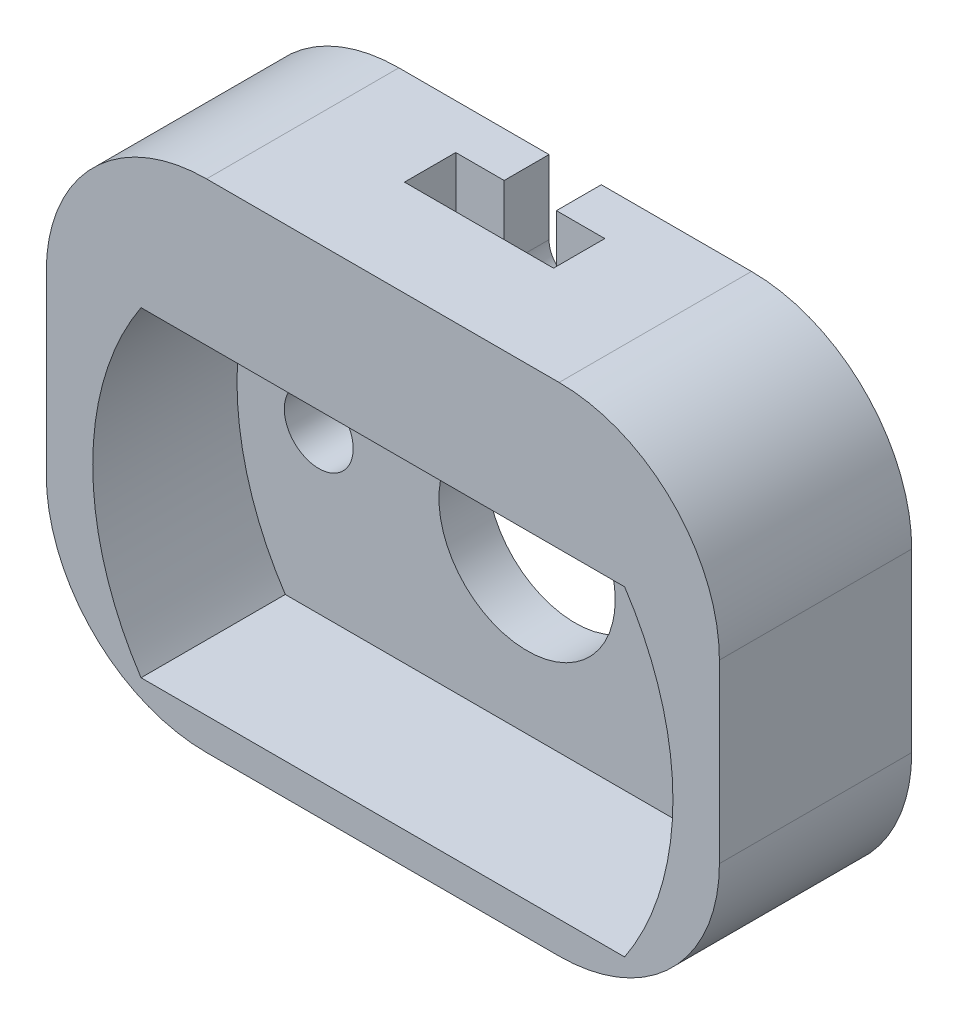
ISO-10303-21;
HEADER;
FILE_DESCRIPTION(('STEP AP214'),'2;1');
FILE_NAME('part.step','',(''),(''),'','','');
FILE_SCHEMA(('AUTOMOTIVE_DESIGN { 1 0 10303 214 1 1 1 1 }'));
ENDSEC;
DATA;
#1=APPLICATION_CONTEXT('core data for automotive mechanical design processes');
#2=APPLICATION_PROTOCOL_DEFINITION('international standard','automotive_design',2000,#1);
#3=PRODUCT_CONTEXT('',#1,'mechanical');
#4=PRODUCT('Part','Part','',(#3));
#5=PRODUCT_RELATED_PRODUCT_CATEGORY('part','',(#4));
#6=PRODUCT_DEFINITION_FORMATION('','',#4);
#7=PRODUCT_DEFINITION_CONTEXT('part definition',#1,'design');
#8=PRODUCT_DEFINITION('design','',#6,#7);
#9=PRODUCT_DEFINITION_SHAPE('','',#8);
#10=(LENGTH_UNIT() NAMED_UNIT(*) SI_UNIT(.MILLI.,.METRE.));
#11=(NAMED_UNIT(*) PLANE_ANGLE_UNIT() SI_UNIT($,.RADIAN.));
#12=(NAMED_UNIT(*) SI_UNIT($,.STERADIAN.) SOLID_ANGLE_UNIT());
#13=UNCERTAINTY_MEASURE_WITH_UNIT(LENGTH_MEASURE(1.E-05),#10,'distance_accuracy_value','');
#14=(GEOMETRIC_REPRESENTATION_CONTEXT(3) GLOBAL_UNCERTAINTY_ASSIGNED_CONTEXT((#13)) GLOBAL_UNIT_ASSIGNED_CONTEXT((#10,
#11,#12)) REPRESENTATION_CONTEXT('',''));
#15=CARTESIAN_POINT('',(0.,0.,0.));
#16=DIRECTION('',(0.,0.,1.));
#17=DIRECTION('',(1.,0.,0.));
#18=AXIS2_PLACEMENT_3D('',#15,#16,#17);
#19=CARTESIAN_POINT('',(0.,0.,12.));
#20=DIRECTION('',(0.,1.,0.));
#21=DIRECTION('',(0.,0.,1.));
#22=AXIS2_PLACEMENT_3D('',#19,#20,#21);
#23=PLANE('',#22);
#24=DIRECTION('',(1.,0.,0.));
#25=VECTOR('',#24,1.);
#26=CARTESIAN_POINT('',(0.,0.,12.));
#27=LINE('',#26,#25);
#28=CARTESIAN_POINT('',(10.,0.,12.));
#29=VERTEX_POINT('',#28);
#30=CARTESIAN_POINT('',(32.,0.,12.));
#31=VERTEX_POINT('',#30);
#32=EDGE_CURVE('E284',#29,#31,#27,.T.);
#33=ORIENTED_EDGE('',*,*,#32,.F.);
#34=DIRECTION('',(0.,0.,-1.));
#35=VECTOR('',#34,1.);
#36=CARTESIAN_POINT('',(10.,0.,0.));
#37=LINE('',#36,#35);
#38=CARTESIAN_POINT('',(10.,0.,0.));
#39=VERTEX_POINT('',#38);
#40=EDGE_CURVE('E329',#29,#39,#37,.T.);
#41=ORIENTED_EDGE('',*,*,#40,.T.);
#42=DIRECTION('',(1.,0.,0.));
#43=VECTOR('',#42,1.);
#44=CARTESIAN_POINT('',(0.,0.,0.));
#45=LINE('',#44,#43);
#46=CARTESIAN_POINT('',(32.,0.,0.));
#47=VERTEX_POINT('',#46);
#48=EDGE_CURVE('E277',#39,#47,#45,.T.);
#49=ORIENTED_EDGE('',*,*,#48,.T.);
#50=DIRECTION('',(0.,0.,-1.));
#51=VECTOR('',#50,1.);
#52=CARTESIAN_POINT('',(32.,0.,12.));
#53=LINE('',#52,#51);
#54=EDGE_CURVE('E327',#47,#31,#53,.F.);
#55=ORIENTED_EDGE('',*,*,#54,.T.);
#56=EDGE_LOOP('',(#33,#41,#49,#55));
#57=FACE_BOUND('',#56,.T.);
#58=ADVANCED_FACE('F34',(#57),#23,.F.);
#59=CARTESIAN_POINT('',(42.,0.,12.));
#60=DIRECTION('',(-1.,0.,0.));
#61=DIRECTION('',(0.,0.,1.));
#62=AXIS2_PLACEMENT_3D('',#59,#60,#61);
#63=PLANE('',#62);
#64=DIRECTION('',(0.,1.,0.));
#65=VECTOR('',#64,1.);
#66=CARTESIAN_POINT('',(42.,0.,12.));
#67=LINE('',#66,#65);
#68=CARTESIAN_POINT('',(42.,10.,12.));
#69=VERTEX_POINT('',#68);
#70=CARTESIAN_POINT('',(42.,21.,12.));
#71=VERTEX_POINT('',#70);
#72=EDGE_CURVE('E286',#69,#71,#67,.T.);
#73=ORIENTED_EDGE('',*,*,#72,.F.);
#74=DIRECTION('',(0.,0.,-1.));
#75=VECTOR('',#74,1.);
#76=CARTESIAN_POINT('',(42.,10.,12.));
#77=LINE('',#76,#75);
#78=CARTESIAN_POINT('',(42.,10.,0.));
#79=VERTEX_POINT('',#78);
#80=EDGE_CURVE('E11',#69,#79,#77,.T.);
#81=ORIENTED_EDGE('',*,*,#80,.T.);
#82=DIRECTION('',(0.,1.,0.));
#83=VECTOR('',#82,1.);
#84=CARTESIAN_POINT('',(42.,0.,0.));
#85=LINE('',#84,#83);
#86=CARTESIAN_POINT('',(42.,21.,0.));
#87=VERTEX_POINT('',#86);
#88=EDGE_CURVE('E298',#79,#87,#85,.T.);
#89=ORIENTED_EDGE('',*,*,#88,.T.);
#90=DIRECTION('',(0.,0.,-1.));
#91=VECTOR('',#90,1.);
#92=CARTESIAN_POINT('',(42.,21.,12.));
#93=LINE('',#92,#91);
#94=EDGE_CURVE('E42',#87,#71,#93,.F.);
#95=ORIENTED_EDGE('',*,*,#94,.T.);
#96=EDGE_LOOP('',(#73,#81,#89,#95));
#97=FACE_BOUND('',#96,.T.);
#98=ADVANCED_FACE('F343',(#97),#63,.F.);
#99=CARTESIAN_POINT('',(0.,31.,12.));
#100=DIRECTION('',(0.,1.,0.));
#101=DIRECTION('',(0.,0.,1.));
#102=AXIS2_PLACEMENT_3D('',#99,#100,#101);
#103=PLANE('',#102);
#104=DIRECTION('',(1.,0.,0.));
#105=VECTOR('',#104,1.);
#106=CARTESIAN_POINT('',(0.,31.,0.));
#107=LINE('',#106,#105);
#108=CARTESIAN_POINT('',(10.,31.,0.));
#109=VERTEX_POINT('',#108);
#110=CARTESIAN_POINT('',(19.37,31.,0.));
#111=VERTEX_POINT('',#110);
#112=EDGE_CURVE('E193',#109,#111,#107,.T.);
#113=ORIENTED_EDGE('',*,*,#112,.F.);
#114=DIRECTION('',(0.,0.,-1.));
#115=VECTOR('',#114,1.);
#116=CARTESIAN_POINT('',(10.,31.,12.));
#117=LINE('',#116,#115);
#118=CARTESIAN_POINT('',(10.,31.,12.));
#119=VERTEX_POINT('',#118);
#120=EDGE_CURVE('E318',#109,#119,#117,.F.);
#121=ORIENTED_EDGE('',*,*,#120,.T.);
#122=DIRECTION('',(1.,0.,0.));
#123=VECTOR('',#122,1.);
#124=CARTESIAN_POINT('',(0.,31.,12.));
#125=LINE('',#124,#123);
#126=CARTESIAN_POINT('',(32.,31.,12.));
#127=VERTEX_POINT('',#126);
#128=EDGE_CURVE('E289',#119,#127,#125,.T.);
#129=ORIENTED_EDGE('',*,*,#128,.T.);
#130=DIRECTION('',(0.,0.,-1.));
#131=VECTOR('',#130,1.);
#132=CARTESIAN_POINT('',(32.,31.,0.));
#133=LINE('',#132,#131);
#134=CARTESIAN_POINT('',(32.,31.,0.));
#135=VERTEX_POINT('',#134);
#136=EDGE_CURVE('E315',#127,#135,#133,.T.);
#137=ORIENTED_EDGE('',*,*,#136,.T.);
#138=CARTESIAN_POINT('',(22.63,31.,0.));
#139=VERTEX_POINT('',#138);
#140=EDGE_CURVE('E300',#139,#135,#107,.T.);
#141=ORIENTED_EDGE('',*,*,#140,.F.);
#142=DIRECTION('',(0.,0.,-1.));
#143=VECTOR('',#142,1.);
#144=CARTESIAN_POINT('',(22.63,31.,8.43804930804973));
#145=LINE('',#144,#143);
#146=CARTESIAN_POINT('',(22.63,31.,2.8));
#147=VERTEX_POINT('',#146);
#148=EDGE_CURVE('E362',#147,#139,#145,.T.);
#149=ORIENTED_EDGE('',*,*,#148,.F.);
#150=DIRECTION('',(-1.,0.,0.));
#151=VECTOR('',#150,1.);
#152=CARTESIAN_POINT('',(25.65,31.,2.8));
#153=LINE('',#152,#151);
#154=CARTESIAN_POINT('',(25.65,31.,2.8));
#155=VERTEX_POINT('',#154);
#156=EDGE_CURVE('E222',#155,#147,#153,.T.);
#157=ORIENTED_EDGE('',*,*,#156,.F.);
#158=DIRECTION('',(0.,0.,-1.));
#159=VECTOR('',#158,1.);
#160=CARTESIAN_POINT('',(25.65,31.,6.));
#161=LINE('',#160,#159);
#162=CARTESIAN_POINT('',(25.65,31.,6.));
#163=VERTEX_POINT('',#162);
#164=EDGE_CURVE('E201',#163,#155,#161,.T.);
#165=ORIENTED_EDGE('',*,*,#164,.F.);
#166=DIRECTION('',(1.,0.,0.));
#167=VECTOR('',#166,1.);
#168=CARTESIAN_POINT('',(25.65,31.,6.));
#169=LINE('',#168,#167);
#170=CARTESIAN_POINT('',(16.35,31.,6.));
#171=VERTEX_POINT('',#170);
#172=EDGE_CURVE('E210',#171,#163,#169,.T.);
#173=ORIENTED_EDGE('',*,*,#172,.F.);
#174=DIRECTION('',(0.,0.,1.));
#175=VECTOR('',#174,1.);
#176=CARTESIAN_POINT('',(16.35,31.,6.));
#177=LINE('',#176,#175);
#178=CARTESIAN_POINT('',(16.35,31.,2.8));
#179=VERTEX_POINT('',#178);
#180=EDGE_CURVE('E225',#179,#171,#177,.T.);
#181=ORIENTED_EDGE('',*,*,#180,.F.);
#182=CARTESIAN_POINT('',(19.37,31.,2.8));
#183=VERTEX_POINT('',#182);
#184=EDGE_CURVE('E221',#183,#179,#153,.T.);
#185=ORIENTED_EDGE('',*,*,#184,.F.);
#186=DIRECTION('',(0.,0.,-1.));
#187=VECTOR('',#186,1.);
#188=CARTESIAN_POINT('',(19.37,31.,8.43804930804973));
#189=LINE('',#188,#187);
#190=EDGE_CURVE('E183',#183,#111,#189,.T.);
#191=ORIENTED_EDGE('',*,*,#190,.T.);
#192=EDGE_LOOP('',(#113,#121,#129,#137,#141,#149,#157,#165,#173,#181,#185,#191));
#193=FACE_BOUND('',#192,.T.);
#194=ADVANCED_FACE('F352',(#193),#103,.T.);
#195=CARTESIAN_POINT('',(0.,0.,12.));
#196=DIRECTION('',(-1.,0.,0.));
#197=DIRECTION('',(0.,0.,1.));
#198=AXIS2_PLACEMENT_3D('',#195,#196,#197);
#199=PLANE('',#198);
#200=DIRECTION('',(0.,1.,0.));
#201=VECTOR('',#200,1.);
#202=CARTESIAN_POINT('',(0.,0.,12.));
#203=LINE('',#202,#201);
#204=CARTESIAN_POINT('',(0.,10.,12.));
#205=VERTEX_POINT('',#204);
#206=CARTESIAN_POINT('',(0.,21.,12.));
#207=VERTEX_POINT('',#206);
#208=EDGE_CURVE('E292',#205,#207,#203,.T.);
#209=ORIENTED_EDGE('',*,*,#208,.T.);
#210=DIRECTION('',(0.,0.,-1.));
#211=VECTOR('',#210,1.);
#212=CARTESIAN_POINT('',(0.,21.,12.));
#213=LINE('',#212,#211);
#214=CARTESIAN_POINT('',(0.,21.,0.));
#215=VERTEX_POINT('',#214);
#216=EDGE_CURVE('E304',#207,#215,#213,.T.);
#217=ORIENTED_EDGE('',*,*,#216,.T.);
#218=DIRECTION('',(0.,1.,0.));
#219=VECTOR('',#218,1.);
#220=CARTESIAN_POINT('',(0.,0.,0.));
#221=LINE('',#220,#219);
#222=CARTESIAN_POINT('',(0.,10.,0.));
#223=VERTEX_POINT('',#222);
#224=EDGE_CURVE('E287',#223,#215,#221,.T.);
#225=ORIENTED_EDGE('',*,*,#224,.F.);
#226=DIRECTION('',(0.,0.,-1.));
#227=VECTOR('',#226,1.);
#228=CARTESIAN_POINT('',(0.,10.,12.));
#229=LINE('',#228,#227);
#230=EDGE_CURVE('E295',#223,#205,#229,.F.);
#231=ORIENTED_EDGE('',*,*,#230,.T.);
#232=EDGE_LOOP('',(#209,#217,#225,#231));
#233=FACE_BOUND('',#232,.T.);
#234=ADVANCED_FACE('F403',(#233),#199,.T.);
#235=CARTESIAN_POINT('',(0.,0.,12.));
#236=DIRECTION('',(0.,0.,1.));
#237=DIRECTION('',(1.,0.,0.));
#238=AXIS2_PLACEMENT_3D('',#235,#236,#237);
#239=PLANE('',#238);
#240=CARTESIAN_POINT('',(21.,12.,12.));
#241=DIRECTION('',(0.,0.,1.));
#242=DIRECTION('',(1.,0.,0.));
#243=AXIS2_PLACEMENT_3D('',#240,#241,#242);
#244=CIRCLE('',#243,18.1);
#245=CARTESIAN_POINT('',(36.0867491528162,2.,12.));
#246=VERTEX_POINT('',#245);
#247=CARTESIAN_POINT('',(36.0867491528162,22.,12.));
#248=VERTEX_POINT('',#247);
#249=EDGE_CURVE('E251',#246,#248,#244,.T.);
#250=ORIENTED_EDGE('',*,*,#249,.F.);
#251=DIRECTION('',(1.,0.,0.));
#252=VECTOR('',#251,1.);
#253=CARTESIAN_POINT('',(5.91325084718381,2.,12.));
#254=LINE('',#253,#252);
#255=CARTESIAN_POINT('',(5.91325084718381,2.00000000000001,12.));
#256=VERTEX_POINT('',#255);
#257=EDGE_CURVE('E256',#256,#246,#254,.T.);
#258=ORIENTED_EDGE('',*,*,#257,.F.);
#259=CARTESIAN_POINT('',(21.,12.,12.));
#260=DIRECTION('',(0.,0.,1.));
#261=DIRECTION('',(1.,0.,0.));
#262=AXIS2_PLACEMENT_3D('',#259,#260,#261);
#263=CIRCLE('',#262,18.1);
#264=CARTESIAN_POINT('',(5.91325084718381,22.,12.));
#265=VERTEX_POINT('',#264);
#266=EDGE_CURVE('E270',#265,#256,#263,.T.);
#267=ORIENTED_EDGE('',*,*,#266,.F.);
#268=DIRECTION('',(-1.,0.,0.));
#269=VECTOR('',#268,1.);
#270=CARTESIAN_POINT('',(36.0867491528162,22.,12.));
#271=LINE('',#270,#269);
#272=EDGE_CURVE('E267',#248,#265,#271,.T.);
#273=ORIENTED_EDGE('',*,*,#272,.F.);
#274=EDGE_LOOP('',(#250,#258,#267,#273));
#275=FACE_BOUND('',#274,.T.);
#276=ORIENTED_EDGE('',*,*,#128,.F.);
#277=CARTESIAN_POINT('',(10.,21.,12.));
#278=DIRECTION('',(0.,0.,1.));
#279=DIRECTION('',(1.,0.,0.));
#280=AXIS2_PLACEMENT_3D('',#277,#278,#279);
#281=CIRCLE('',#280,10.);
#282=EDGE_CURVE('E325',#119,#207,#281,.T.);
#283=ORIENTED_EDGE('',*,*,#282,.T.);
#284=ORIENTED_EDGE('',*,*,#208,.F.);
#285=CARTESIAN_POINT('',(10.,10.,12.));
#286=DIRECTION('',(0.,0.,1.));
#287=DIRECTION('',(1.,0.,0.));
#288=AXIS2_PLACEMENT_3D('',#285,#286,#287);
#289=CIRCLE('',#288,10.);
#290=EDGE_CURVE('E323',#205,#29,#289,.T.);
#291=ORIENTED_EDGE('',*,*,#290,.T.);
#292=ORIENTED_EDGE('',*,*,#32,.T.);
#293=CARTESIAN_POINT('',(32.,10.,12.));
#294=DIRECTION('',(0.,0.,1.));
#295=DIRECTION('',(1.,0.,0.));
#296=AXIS2_PLACEMENT_3D('',#293,#294,#295);
#297=CIRCLE('',#296,10.);
#298=EDGE_CURVE('E55',#31,#69,#297,.T.);
#299=ORIENTED_EDGE('',*,*,#298,.T.);
#300=ORIENTED_EDGE('',*,*,#72,.T.);
#301=CARTESIAN_POINT('',(32.,21.,12.));
#302=DIRECTION('',(0.,0.,1.));
#303=DIRECTION('',(1.,0.,0.));
#304=AXIS2_PLACEMENT_3D('',#301,#302,#303);
#305=CIRCLE('',#304,10.);
#306=EDGE_CURVE('E320',#71,#127,#305,.T.);
#307=ORIENTED_EDGE('',*,*,#306,.T.);
#308=EDGE_LOOP('',(#276,#283,#284,#291,#292,#299,#300,#307));
#309=FACE_BOUND('',#308,.T.);
#310=ADVANCED_FACE('F346',(#275,#309),#239,.T.);
#311=CARTESIAN_POINT('',(0.,0.,0.));
#312=DIRECTION('',(0.,0.,1.));
#313=DIRECTION('',(1.,0.,0.));
#314=AXIS2_PLACEMENT_3D('',#311,#312,#313);
#315=PLANE('',#314);
#316=CARTESIAN_POINT('',(21.,12.,0.));
#317=DIRECTION('',(0.,0.,1.));
#318=DIRECTION('',(1.,0.,0.));
#319=AXIS2_PLACEMENT_3D('',#316,#317,#318);
#320=CIRCLE('',#319,5.5);
#321=CARTESIAN_POINT('',(26.5,12.,0.));
#322=VERTEX_POINT('',#321);
#323=EDGE_CURVE('E355',#322,#322,#320,.T.);
#324=ORIENTED_EDGE('',*,*,#323,.T.);
#325=EDGE_LOOP('',(#324));
#326=FACE_BOUND('',#325,.T.);
#327=CARTESIAN_POINT('',(8.,12.,0.));
#328=DIRECTION('',(0.,0.,1.));
#329=DIRECTION('',(1.,0.,0.));
#330=AXIS2_PLACEMENT_3D('',#327,#328,#329);
#331=CIRCLE('',#330,2.15);
#332=CARTESIAN_POINT('',(10.15,12.,0.));
#333=VERTEX_POINT('',#332);
#334=EDGE_CURVE('E248',#333,#333,#331,.T.);
#335=ORIENTED_EDGE('',*,*,#334,.T.);
#336=EDGE_LOOP('',(#335));
#337=FACE_BOUND('',#336,.T.);
#338=CARTESIAN_POINT('',(34.,12.,0.));
#339=DIRECTION('',(0.,0.,1.));
#340=DIRECTION('',(1.,0.,0.));
#341=AXIS2_PLACEMENT_3D('',#338,#339,#340);
#342=CIRCLE('',#341,2.15);
#343=CARTESIAN_POINT('',(36.15,12.,0.));
#344=VERTEX_POINT('',#343);
#345=EDGE_CURVE('E243',#344,#344,#342,.T.);
#346=ORIENTED_EDGE('',*,*,#345,.T.);
#347=EDGE_LOOP('',(#346));
#348=FACE_BOUND('',#347,.T.);
#349=ORIENTED_EDGE('',*,*,#224,.T.);
#350=CARTESIAN_POINT('',(10.,21.,0.));
#351=DIRECTION('',(0.,0.,1.));
#352=DIRECTION('',(1.,0.,0.));
#353=AXIS2_PLACEMENT_3D('',#350,#351,#352);
#354=CIRCLE('',#353,10.);
#355=EDGE_CURVE('E313',#215,#109,#354,.F.);
#356=ORIENTED_EDGE('',*,*,#355,.T.);
#357=ORIENTED_EDGE('',*,*,#112,.T.);
#358=DIRECTION('',(0.,1.,0.));
#359=VECTOR('',#358,1.);
#360=CARTESIAN_POINT('',(19.37,31.,0.));
#361=LINE('',#360,#359);
#362=CARTESIAN_POINT('',(19.37,26.4,0.));
#363=VERTEX_POINT('',#362);
#364=EDGE_CURVE('E175',#363,#111,#361,.T.);
#365=ORIENTED_EDGE('',*,*,#364,.F.);
#366=CARTESIAN_POINT('',(21.,26.4,0.));
#367=DIRECTION('',(0.,0.,-1.));
#368=DIRECTION('',(-1.,0.,0.));
#369=AXIS2_PLACEMENT_3D('',#366,#367,#368);
#370=CIRCLE('',#369,1.63);
#371=CARTESIAN_POINT('',(22.63,26.4,0.));
#372=VERTEX_POINT('',#371);
#373=EDGE_CURVE('E191',#372,#363,#370,.T.);
#374=ORIENTED_EDGE('',*,*,#373,.F.);
#375=DIRECTION('',(0.,-1.,0.));
#376=VECTOR('',#375,1.);
#377=CARTESIAN_POINT('',(22.63,31.,0.));
#378=LINE('',#377,#376);
#379=EDGE_CURVE('E194',#139,#372,#378,.T.);
#380=ORIENTED_EDGE('',*,*,#379,.F.);
#381=ORIENTED_EDGE('',*,*,#140,.T.);
#382=CARTESIAN_POINT('',(32.,21.,0.));
#383=DIRECTION('',(0.,0.,1.));
#384=DIRECTION('',(1.,0.,0.));
#385=AXIS2_PLACEMENT_3D('',#382,#383,#384);
#386=CIRCLE('',#385,10.);
#387=EDGE_CURVE('E307',#135,#87,#386,.F.);
#388=ORIENTED_EDGE('',*,*,#387,.T.);
#389=ORIENTED_EDGE('',*,*,#88,.F.);
#390=CARTESIAN_POINT('',(32.,10.,0.));
#391=DIRECTION('',(0.,0.,1.));
#392=DIRECTION('',(1.,0.,0.));
#393=AXIS2_PLACEMENT_3D('',#390,#391,#392);
#394=CIRCLE('',#393,10.);
#395=EDGE_CURVE('E309',#79,#47,#394,.F.);
#396=ORIENTED_EDGE('',*,*,#395,.T.);
#397=ORIENTED_EDGE('',*,*,#48,.F.);
#398=CARTESIAN_POINT('',(10.,10.,0.));
#399=DIRECTION('',(0.,0.,1.));
#400=DIRECTION('',(1.,0.,0.));
#401=AXIS2_PLACEMENT_3D('',#398,#399,#400);
#402=CIRCLE('',#401,10.);
#403=EDGE_CURVE('E311',#39,#223,#402,.F.);
#404=ORIENTED_EDGE('',*,*,#403,.T.);
#405=EDGE_LOOP('',(#349,#356,#357,#365,#374,#380,#381,#388,#389,#396,#397,#404));
#406=FACE_BOUND('',#405,.T.);
#407=ADVANCED_FACE('F189',(#326,#337,#348,#406),#315,.F.);
#408=CARTESIAN_POINT('',(21.,12.,3.));
#409=DIRECTION('',(0.,0.,1.));
#410=DIRECTION('',(1.,0.,0.));
#411=AXIS2_PLACEMENT_3D('',#408,#409,#410);
#412=CYLINDRICAL_SURFACE('',#411,18.1);
#413=ORIENTED_EDGE('',*,*,#249,.T.);
#414=DIRECTION('',(0.,0.,1.));
#415=VECTOR('',#414,1.);
#416=CARTESIAN_POINT('',(36.0867491528162,22.,3.));
#417=LINE('',#416,#415);
#418=CARTESIAN_POINT('',(36.0867491528162,22.,3.));
#419=VERTEX_POINT('',#418);
#420=EDGE_CURVE('E265',#419,#248,#417,.T.);
#421=ORIENTED_EDGE('',*,*,#420,.F.);
#422=CARTESIAN_POINT('',(21.,12.,3.));
#423=DIRECTION('',(0.,0.,1.));
#424=DIRECTION('',(1.,0.,0.));
#425=AXIS2_PLACEMENT_3D('',#422,#423,#424);
#426=CIRCLE('',#425,18.1);
#427=CARTESIAN_POINT('',(36.0867491528162,2.,3.));
#428=VERTEX_POINT('',#427);
#429=EDGE_CURVE('E252',#428,#419,#426,.T.);
#430=ORIENTED_EDGE('',*,*,#429,.F.);
#431=DIRECTION('',(0.,0.,1.));
#432=VECTOR('',#431,1.);
#433=CARTESIAN_POINT('',(36.0867491528162,2.,3.));
#434=LINE('',#433,#432);
#435=EDGE_CURVE('E275',#428,#246,#434,.T.);
#436=ORIENTED_EDGE('',*,*,#435,.T.);
#437=EDGE_LOOP('',(#413,#421,#430,#436));
#438=FACE_BOUND('',#437,.T.);
#439=ADVANCED_FACE('F390',(#438),#412,.F.);
#440=CARTESIAN_POINT('',(5.91325084718381,2.,3.));
#441=DIRECTION('',(0.,-1.,0.));
#442=DIRECTION('',(0.,0.,-1.));
#443=AXIS2_PLACEMENT_3D('',#440,#441,#442);
#444=PLANE('',#443);
#445=ORIENTED_EDGE('',*,*,#257,.T.);
#446=ORIENTED_EDGE('',*,*,#435,.F.);
#447=DIRECTION('',(1.,0.,0.));
#448=VECTOR('',#447,1.);
#449=CARTESIAN_POINT('',(5.91325084718381,2.,3.));
#450=LINE('',#449,#448);
#451=CARTESIAN_POINT('',(5.91325084718381,2.00000000000001,3.));
#452=VERTEX_POINT('',#451);
#453=EDGE_CURVE('E262',#452,#428,#450,.T.);
#454=ORIENTED_EDGE('',*,*,#453,.F.);
#455=DIRECTION('',(0.,0.,1.));
#456=VECTOR('',#455,1.);
#457=CARTESIAN_POINT('',(5.91325084718381,2.00000000000001,3.));
#458=LINE('',#457,#456);
#459=EDGE_CURVE('E278',#452,#256,#458,.T.);
#460=ORIENTED_EDGE('',*,*,#459,.T.);
#461=EDGE_LOOP('',(#445,#446,#454,#460));
#462=FACE_BOUND('',#461,.T.);
#463=ADVANCED_FACE('F399',(#462),#444,.F.);
#464=CARTESIAN_POINT('',(21.,12.,3.));
#465=DIRECTION('',(0.,0.,1.));
#466=DIRECTION('',(1.,0.,0.));
#467=AXIS2_PLACEMENT_3D('',#464,#465,#466);
#468=CYLINDRICAL_SURFACE('',#467,18.1);
#469=ORIENTED_EDGE('',*,*,#266,.T.);
#470=ORIENTED_EDGE('',*,*,#459,.F.);
#471=CARTESIAN_POINT('',(21.,12.,3.));
#472=DIRECTION('',(0.,0.,1.));
#473=DIRECTION('',(1.,0.,0.));
#474=AXIS2_PLACEMENT_3D('',#471,#472,#473);
#475=CIRCLE('',#474,18.1);
#476=CARTESIAN_POINT('',(5.91325084718381,22.,3.));
#477=VERTEX_POINT('',#476);
#478=EDGE_CURVE('E259',#477,#452,#475,.T.);
#479=ORIENTED_EDGE('',*,*,#478,.F.);
#480=DIRECTION('',(0.,0.,1.));
#481=VECTOR('',#480,1.);
#482=CARTESIAN_POINT('',(5.91325084718381,22.,3.));
#483=LINE('',#482,#481);
#484=EDGE_CURVE('E280',#477,#265,#483,.T.);
#485=ORIENTED_EDGE('',*,*,#484,.T.);
#486=EDGE_LOOP('',(#469,#470,#479,#485));
#487=FACE_BOUND('',#486,.T.);
#488=ADVANCED_FACE('F397',(#487),#468,.F.);
#489=CARTESIAN_POINT('',(36.0867491528162,22.,3.));
#490=DIRECTION('',(0.,1.,0.));
#491=DIRECTION('',(0.,0.,1.));
#492=AXIS2_PLACEMENT_3D('',#489,#490,#491);
#493=PLANE('',#492);
#494=ORIENTED_EDGE('',*,*,#272,.T.);
#495=ORIENTED_EDGE('',*,*,#484,.F.);
#496=DIRECTION('',(-1.,0.,0.));
#497=VECTOR('',#496,1.);
#498=CARTESIAN_POINT('',(36.0867491528162,22.,3.));
#499=LINE('',#498,#497);
#500=EDGE_CURVE('E255',#419,#477,#499,.T.);
#501=ORIENTED_EDGE('',*,*,#500,.F.);
#502=ORIENTED_EDGE('',*,*,#420,.T.);
#503=EDGE_LOOP('',(#494,#495,#501,#502));
#504=FACE_BOUND('',#503,.T.);
#505=ADVANCED_FACE('F380',(#504),#493,.F.);
#506=CARTESIAN_POINT('',(21.,12.,3.));
#507=DIRECTION('',(0.,0.,1.));
#508=DIRECTION('',(1.,0.,0.));
#509=AXIS2_PLACEMENT_3D('',#506,#507,#508);
#510=PLANE('',#509);
#511=CARTESIAN_POINT('',(21.,12.,3.));
#512=DIRECTION('',(0.,0.,1.));
#513=DIRECTION('',(1.,0.,0.));
#514=AXIS2_PLACEMENT_3D('',#511,#512,#513);
#515=CIRCLE('',#514,5.5);
#516=CARTESIAN_POINT('',(26.5,12.,3.));
#517=VERTEX_POINT('',#516);
#518=EDGE_CURVE('E358',#517,#517,#515,.T.);
#519=ORIENTED_EDGE('',*,*,#518,.F.);
#520=EDGE_LOOP('',(#519));
#521=FACE_BOUND('',#520,.T.);
#522=CARTESIAN_POINT('',(8.,12.,3.));
#523=DIRECTION('',(0.,0.,1.));
#524=DIRECTION('',(1.,0.,0.));
#525=AXIS2_PLACEMENT_3D('',#522,#523,#524);
#526=CIRCLE('',#525,2.15);
#527=CARTESIAN_POINT('',(10.15,12.,3.));
#528=VERTEX_POINT('',#527);
#529=EDGE_CURVE('E240',#528,#528,#526,.T.);
#530=ORIENTED_EDGE('',*,*,#529,.F.);
#531=EDGE_LOOP('',(#530));
#532=FACE_BOUND('',#531,.T.);
#533=CARTESIAN_POINT('',(34.,12.,3.));
#534=DIRECTION('',(0.,0.,1.));
#535=DIRECTION('',(1.,0.,0.));
#536=AXIS2_PLACEMENT_3D('',#533,#534,#535);
#537=CIRCLE('',#536,2.15);
#538=CARTESIAN_POINT('',(36.15,12.,3.));
#539=VERTEX_POINT('',#538);
#540=EDGE_CURVE('E232',#539,#539,#537,.T.);
#541=ORIENTED_EDGE('',*,*,#540,.F.);
#542=EDGE_LOOP('',(#541));
#543=FACE_BOUND('',#542,.T.);
#544=ORIENTED_EDGE('',*,*,#429,.T.);
#545=ORIENTED_EDGE('',*,*,#500,.T.);
#546=ORIENTED_EDGE('',*,*,#478,.T.);
#547=ORIENTED_EDGE('',*,*,#453,.T.);
#548=EDGE_LOOP('',(#544,#545,#546,#547));
#549=FACE_BOUND('',#548,.T.);
#550=ADVANCED_FACE('F376',(#521,#532,#543,#549),#510,.T.);
#551=CARTESIAN_POINT('',(34.,12.,-7.));
#552=DIRECTION('',(0.,0.,1.));
#553=DIRECTION('',(1.,0.,0.));
#554=AXIS2_PLACEMENT_3D('',#551,#552,#553);
#555=CYLINDRICAL_SURFACE('',#554,2.15);
#556=ORIENTED_EDGE('',*,*,#540,.T.);
#557=EDGE_LOOP('',(#556));
#558=FACE_BOUND('',#557,.T.);
#559=ORIENTED_EDGE('',*,*,#345,.F.);
#560=EDGE_LOOP('',(#559));
#561=FACE_BOUND('',#560,.T.);
#562=ADVANCED_FACE('F379',(#558,#561),#555,.F.);
#563=CARTESIAN_POINT('',(8.,12.,-7.));
#564=DIRECTION('',(0.,0.,1.));
#565=DIRECTION('',(1.,0.,0.));
#566=AXIS2_PLACEMENT_3D('',#563,#564,#565);
#567=CYLINDRICAL_SURFACE('',#566,2.15);
#568=ORIENTED_EDGE('',*,*,#529,.T.);
#569=EDGE_LOOP('',(#568));
#570=FACE_BOUND('',#569,.T.);
#571=ORIENTED_EDGE('',*,*,#334,.F.);
#572=EDGE_LOOP('',(#571));
#573=FACE_BOUND('',#572,.T.);
#574=ADVANCED_FACE('F465',(#570,#573),#567,.F.);
#575=CARTESIAN_POINT('',(25.65,22.72,6.));
#576=DIRECTION('',(1.,0.,0.));
#577=DIRECTION('',(0.,0.,-1.));
#578=AXIS2_PLACEMENT_3D('',#575,#576,#577);
#579=PLANE('',#578);
#580=ORIENTED_EDGE('',*,*,#164,.T.);
#581=DIRECTION('',(0.,1.,0.));
#582=VECTOR('',#581,1.);
#583=CARTESIAN_POINT('',(25.65,22.72,2.8));
#584=LINE('',#583,#582);
#585=CARTESIAN_POINT('',(25.65,22.72,2.8));
#586=VERTEX_POINT('',#585);
#587=EDGE_CURVE('E219',#586,#155,#584,.T.);
#588=ORIENTED_EDGE('',*,*,#587,.F.);
#589=DIRECTION('',(0.,0.,-1.));
#590=VECTOR('',#589,1.);
#591=CARTESIAN_POINT('',(25.65,22.72,6.));
#592=LINE('',#591,#590);
#593=CARTESIAN_POINT('',(25.65,22.72,6.));
#594=VERTEX_POINT('',#593);
#595=EDGE_CURVE('E206',#594,#586,#592,.T.);
#596=ORIENTED_EDGE('',*,*,#595,.F.);
#597=DIRECTION('',(0.,1.,0.));
#598=VECTOR('',#597,1.);
#599=CARTESIAN_POINT('',(25.65,22.72,6.));
#600=LINE('',#599,#598);
#601=EDGE_CURVE('E230',#594,#163,#600,.T.);
#602=ORIENTED_EDGE('',*,*,#601,.T.);
#603=EDGE_LOOP('',(#580,#588,#596,#602));
#604=FACE_BOUND('',#603,.T.);
#605=ADVANCED_FACE('F456',(#604),#579,.F.);
#606=CARTESIAN_POINT('',(25.65,22.72,6.));
#607=DIRECTION('',(0.,0.,1.));
#608=DIRECTION('',(1.,0.,0.));
#609=AXIS2_PLACEMENT_3D('',#606,#607,#608);
#610=PLANE('',#609);
#611=ORIENTED_EDGE('',*,*,#172,.T.);
#612=ORIENTED_EDGE('',*,*,#601,.F.);
#613=DIRECTION('',(1.,0.,0.));
#614=VECTOR('',#613,1.);
#615=CARTESIAN_POINT('',(25.65,22.72,6.));
#616=LINE('',#615,#614);
#617=CARTESIAN_POINT('',(16.35,22.72,6.));
#618=VERTEX_POINT('',#617);
#619=EDGE_CURVE('E216',#618,#594,#616,.T.);
#620=ORIENTED_EDGE('',*,*,#619,.F.);
#621=DIRECTION('',(0.,1.,0.));
#622=VECTOR('',#621,1.);
#623=CARTESIAN_POINT('',(16.35,22.72,6.));
#624=LINE('',#623,#622);
#625=EDGE_CURVE('E233',#618,#171,#624,.T.);
#626=ORIENTED_EDGE('',*,*,#625,.T.);
#627=EDGE_LOOP('',(#611,#612,#620,#626));
#628=FACE_BOUND('',#627,.T.);
#629=ADVANCED_FACE('F452',(#628),#610,.F.);
#630=CARTESIAN_POINT('',(16.35,22.72,6.));
#631=DIRECTION('',(-1.,0.,0.));
#632=DIRECTION('',(0.,0.,1.));
#633=AXIS2_PLACEMENT_3D('',#630,#631,#632);
#634=PLANE('',#633);
#635=ORIENTED_EDGE('',*,*,#180,.T.);
#636=ORIENTED_EDGE('',*,*,#625,.F.);
#637=DIRECTION('',(0.,0.,1.));
#638=VECTOR('',#637,1.);
#639=CARTESIAN_POINT('',(16.35,22.72,6.));
#640=LINE('',#639,#638);
#641=CARTESIAN_POINT('',(16.35,22.72,2.8));
#642=VERTEX_POINT('',#641);
#643=EDGE_CURVE('E213',#642,#618,#640,.T.);
#644=ORIENTED_EDGE('',*,*,#643,.F.);
#645=DIRECTION('',(0.,1.,0.));
#646=VECTOR('',#645,1.);
#647=CARTESIAN_POINT('',(16.35,22.72,2.8));
#648=LINE('',#647,#646);
#649=EDGE_CURVE('E235',#642,#179,#648,.T.);
#650=ORIENTED_EDGE('',*,*,#649,.T.);
#651=EDGE_LOOP('',(#635,#636,#644,#650));
#652=FACE_BOUND('',#651,.T.);
#653=ADVANCED_FACE('F455',(#652),#634,.F.);
#654=CARTESIAN_POINT('',(25.65,22.72,2.8));
#655=DIRECTION('',(0.,0.,-1.));
#656=DIRECTION('',(-1.,0.,0.));
#657=AXIS2_PLACEMENT_3D('',#654,#655,#656);
#658=PLANE('',#657);
#659=ORIENTED_EDGE('',*,*,#156,.T.);
#660=DIRECTION('',(0.,1.,0.));
#661=VECTOR('',#660,1.);
#662=CARTESIAN_POINT('',(22.63,31.,2.8));
#663=LINE('',#662,#661);
#664=CARTESIAN_POINT('',(22.63,26.4,2.8));
#665=VERTEX_POINT('',#664);
#666=EDGE_CURVE('E199',#665,#147,#663,.T.);
#667=ORIENTED_EDGE('',*,*,#666,.F.);
#668=CARTESIAN_POINT('',(21.,26.4,2.8));
#669=DIRECTION('',(0.,0.,-1.));
#670=DIRECTION('',(-1.,0.,0.));
#671=AXIS2_PLACEMENT_3D('',#668,#669,#670);
#672=CIRCLE('',#671,1.63);
#673=CARTESIAN_POINT('',(19.37,26.4,2.8));
#674=VERTEX_POINT('',#673);
#675=EDGE_CURVE('E198',#674,#665,#672,.F.);
#676=ORIENTED_EDGE('',*,*,#675,.F.);
#677=DIRECTION('',(0.,-1.,0.));
#678=VECTOR('',#677,1.);
#679=CARTESIAN_POINT('',(19.37,31.,2.8));
#680=LINE('',#679,#678);
#681=EDGE_CURVE('E178',#183,#674,#680,.T.);
#682=ORIENTED_EDGE('',*,*,#681,.F.);
#683=ORIENTED_EDGE('',*,*,#184,.T.);
#684=ORIENTED_EDGE('',*,*,#649,.F.);
#685=DIRECTION('',(-1.,0.,0.));
#686=VECTOR('',#685,1.);
#687=CARTESIAN_POINT('',(25.65,22.72,2.8));
#688=LINE('',#687,#686);
#689=EDGE_CURVE('E209',#586,#642,#688,.T.);
#690=ORIENTED_EDGE('',*,*,#689,.F.);
#691=ORIENTED_EDGE('',*,*,#587,.T.);
#692=EDGE_LOOP('',(#659,#667,#676,#682,#683,#684,#690,#691));
#693=FACE_BOUND('',#692,.T.);
#694=ADVANCED_FACE('F368',(#693),#658,.F.);
#695=CARTESIAN_POINT('',(0.,22.72,0.));
#696=DIRECTION('',(0.,1.,0.));
#697=DIRECTION('',(0.,0.,1.));
#698=AXIS2_PLACEMENT_3D('',#695,#696,#697);
#699=PLANE('',#698);
#700=ORIENTED_EDGE('',*,*,#595,.T.);
#701=ORIENTED_EDGE('',*,*,#689,.T.);
#702=ORIENTED_EDGE('',*,*,#643,.T.);
#703=ORIENTED_EDGE('',*,*,#619,.T.);
#704=EDGE_LOOP('',(#700,#701,#702,#703));
#705=FACE_BOUND('',#704,.T.);
#706=ADVANCED_FACE('F448',(#705),#699,.T.);
#707=CARTESIAN_POINT('',(21.,26.4,7.41033621333629));
#708=DIRECTION('',(0.,0.,-1.));
#709=DIRECTION('',(-1.,0.,0.));
#710=AXIS2_PLACEMENT_3D('',#707,#708,#709);
#711=CYLINDRICAL_SURFACE('',#710,1.63);
#712=ORIENTED_EDGE('',*,*,#373,.T.);
#713=DIRECTION('',(0.,0.,-1.));
#714=VECTOR('',#713,1.);
#715=CARTESIAN_POINT('',(19.37,26.4,8.43804930804973));
#716=LINE('',#715,#714);
#717=EDGE_CURVE('E172',#674,#363,#716,.T.);
#718=ORIENTED_EDGE('',*,*,#717,.F.);
#719=ORIENTED_EDGE('',*,*,#675,.T.);
#720=DIRECTION('',(0.,0.,-1.));
#721=VECTOR('',#720,1.);
#722=CARTESIAN_POINT('',(22.63,26.4,8.43804930804973));
#723=LINE('',#722,#721);
#724=EDGE_CURVE('E184',#665,#372,#723,.T.);
#725=ORIENTED_EDGE('',*,*,#724,.T.);
#726=EDGE_LOOP('',(#712,#718,#719,#725));
#727=FACE_BOUND('',#726,.T.);
#728=ADVANCED_FACE('F197',(#727),#711,.F.);
#729=CARTESIAN_POINT('',(22.63,31.,8.43804930804973));
#730=DIRECTION('',(1.,0.,0.));
#731=DIRECTION('',(0.,0.,-1.));
#732=AXIS2_PLACEMENT_3D('',#729,#730,#731);
#733=PLANE('',#732);
#734=ORIENTED_EDGE('',*,*,#666,.T.);
#735=ORIENTED_EDGE('',*,*,#148,.T.);
#736=ORIENTED_EDGE('',*,*,#379,.T.);
#737=ORIENTED_EDGE('',*,*,#724,.F.);
#738=EDGE_LOOP('',(#734,#735,#736,#737));
#739=FACE_BOUND('',#738,.T.);
#740=ADVANCED_FACE('F443',(#739),#733,.F.);
#741=CARTESIAN_POINT('',(19.37,31.,8.43804930804973));
#742=DIRECTION('',(-1.,0.,0.));
#743=DIRECTION('',(0.,0.,1.));
#744=AXIS2_PLACEMENT_3D('',#741,#742,#743);
#745=PLANE('',#744);
#746=ORIENTED_EDGE('',*,*,#681,.T.);
#747=ORIENTED_EDGE('',*,*,#717,.T.);
#748=ORIENTED_EDGE('',*,*,#364,.T.);
#749=ORIENTED_EDGE('',*,*,#190,.F.);
#750=EDGE_LOOP('',(#746,#747,#748,#749));
#751=FACE_BOUND('',#750,.T.);
#752=ADVANCED_FACE('F174',(#751),#745,.F.);
#753=CARTESIAN_POINT('',(10.,21.,12.));
#754=DIRECTION('',(0.,0.,-1.));
#755=DIRECTION('',(-1.,0.,0.));
#756=AXIS2_PLACEMENT_3D('',#753,#754,#755);
#757=CYLINDRICAL_SURFACE('',#756,10.);
#758=ORIENTED_EDGE('',*,*,#282,.F.);
#759=ORIENTED_EDGE('',*,*,#120,.F.);
#760=ORIENTED_EDGE('',*,*,#355,.F.);
#761=ORIENTED_EDGE('',*,*,#216,.F.);
#762=EDGE_LOOP('',(#758,#759,#760,#761));
#763=FACE_BOUND('',#762,.T.);
#764=ADVANCED_FACE('F422',(#763),#757,.T.);
#765=CARTESIAN_POINT('',(10.,10.,12.));
#766=DIRECTION('',(0.,0.,1.));
#767=DIRECTION('',(1.,0.,0.));
#768=AXIS2_PLACEMENT_3D('',#765,#766,#767);
#769=CYLINDRICAL_SURFACE('',#768,10.);
#770=ORIENTED_EDGE('',*,*,#290,.F.);
#771=ORIENTED_EDGE('',*,*,#230,.F.);
#772=ORIENTED_EDGE('',*,*,#403,.F.);
#773=ORIENTED_EDGE('',*,*,#40,.F.);
#774=EDGE_LOOP('',(#770,#771,#772,#773));
#775=FACE_BOUND('',#774,.T.);
#776=ADVANCED_FACE('F425',(#775),#769,.T.);
#777=CARTESIAN_POINT('',(32.,10.,12.));
#778=DIRECTION('',(0.,0.,-1.));
#779=DIRECTION('',(-1.,0.,0.));
#780=AXIS2_PLACEMENT_3D('',#777,#778,#779);
#781=CYLINDRICAL_SURFACE('',#780,10.);
#782=ORIENTED_EDGE('',*,*,#298,.F.);
#783=ORIENTED_EDGE('',*,*,#54,.F.);
#784=ORIENTED_EDGE('',*,*,#395,.F.);
#785=ORIENTED_EDGE('',*,*,#80,.F.);
#786=EDGE_LOOP('',(#782,#783,#784,#785));
#787=FACE_BOUND('',#786,.T.);
#788=ADVANCED_FACE('F342',(#787),#781,.T.);
#789=CARTESIAN_POINT('',(32.,21.,12.));
#790=DIRECTION('',(0.,0.,1.));
#791=DIRECTION('',(1.,0.,0.));
#792=AXIS2_PLACEMENT_3D('',#789,#790,#791);
#793=CYLINDRICAL_SURFACE('',#792,10.);
#794=ORIENTED_EDGE('',*,*,#306,.F.);
#795=ORIENTED_EDGE('',*,*,#94,.F.);
#796=ORIENTED_EDGE('',*,*,#387,.F.);
#797=ORIENTED_EDGE('',*,*,#136,.F.);
#798=EDGE_LOOP('',(#794,#795,#796,#797));
#799=FACE_BOUND('',#798,.T.);
#800=ADVANCED_FACE('F36',(#799),#793,.T.);
#801=CARTESIAN_POINT('',(21.,12.,0.));
#802=DIRECTION('',(0.,0.,1.));
#803=DIRECTION('',(1.,0.,0.));
#804=AXIS2_PLACEMENT_3D('',#801,#802,#803);
#805=CYLINDRICAL_SURFACE('',#804,5.5);
#806=ORIENTED_EDGE('',*,*,#323,.F.);
#807=EDGE_LOOP('',(#806));
#808=FACE_BOUND('',#807,.T.);
#809=ORIENTED_EDGE('',*,*,#518,.T.);
#810=EDGE_LOOP('',(#809));
#811=FACE_BOUND('',#810,.T.);
#812=ADVANCED_FACE('F374',(#808,#811),#805,.F.);
#813=CLOSED_SHELL('',(#58,#98,#194,#234,#310,#407,#439,#463,#488,#505,#550,#562,#574,#605,#629,
#653,#694,#706,#728,#740,#752,#764,#776,#788,#800,#812));
#814=MANIFOLD_SOLID_BREP('B2',#813);
#815=ADVANCED_BREP_SHAPE_REPRESENTATION('',(#18,#814),#14);
#816=SHAPE_DEFINITION_REPRESENTATION(#9,#815);
ENDSEC;
END-ISO-10303-21;
